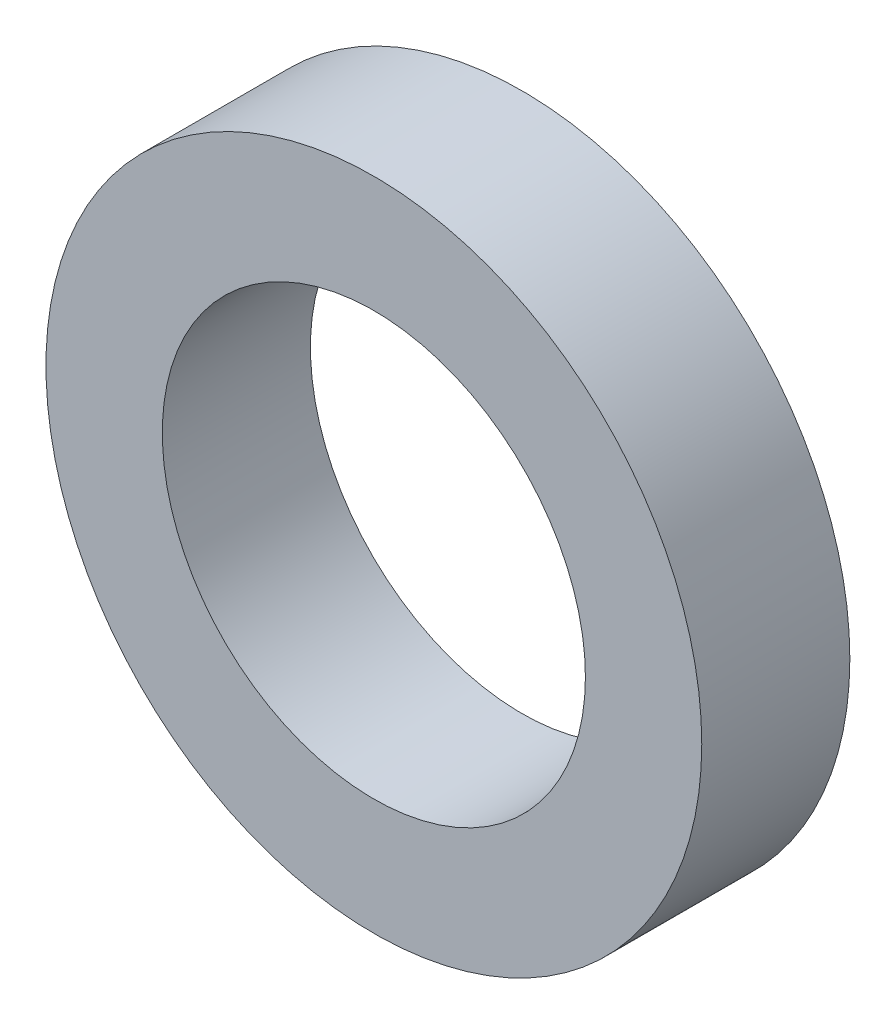
ISO-10303-21;
HEADER;
FILE_DESCRIPTION(('STEP AP214'),'2;1');
FILE_NAME('part.step','',(''),(''),'','','');
FILE_SCHEMA(('AUTOMOTIVE_DESIGN { 1 0 10303 214 1 1 1 1 }'));
ENDSEC;
DATA;
#1=APPLICATION_CONTEXT('core data for automotive mechanical design processes');
#2=APPLICATION_PROTOCOL_DEFINITION('international standard','automotive_design',2000,#1);
#3=PRODUCT_CONTEXT('',#1,'mechanical');
#4=PRODUCT('Part','Part','',(#3));
#5=PRODUCT_RELATED_PRODUCT_CATEGORY('part','',(#4));
#6=PRODUCT_DEFINITION_FORMATION('','',#4);
#7=PRODUCT_DEFINITION_CONTEXT('part definition',#1,'design');
#8=PRODUCT_DEFINITION('design','',#6,#7);
#9=PRODUCT_DEFINITION_SHAPE('','',#8);
#10=(LENGTH_UNIT() NAMED_UNIT(*) SI_UNIT(.MILLI.,.METRE.));
#11=(NAMED_UNIT(*) PLANE_ANGLE_UNIT() SI_UNIT($,.RADIAN.));
#12=(NAMED_UNIT(*) SI_UNIT($,.STERADIAN.) SOLID_ANGLE_UNIT());
#13=UNCERTAINTY_MEASURE_WITH_UNIT(LENGTH_MEASURE(1.E-05),#10,'distance_accuracy_value','');
#14=(GEOMETRIC_REPRESENTATION_CONTEXT(3) GLOBAL_UNCERTAINTY_ASSIGNED_CONTEXT((#13)) GLOBAL_UNIT_ASSIGNED_CONTEXT((#10,
#11,#12)) REPRESENTATION_CONTEXT('',''));
#15=CARTESIAN_POINT('',(0.,0.,0.));
#16=DIRECTION('',(0.,0.,1.));
#17=DIRECTION('',(1.,0.,0.));
#18=AXIS2_PLACEMENT_3D('',#15,#16,#17);
#19=CARTESIAN_POINT('',(0.,0.,-1.75));
#20=DIRECTION('',(0.,0.,1.));
#21=DIRECTION('',(1.,0.,0.));
#22=AXIS2_PLACEMENT_3D('',#19,#20,#21);
#23=CYLINDRICAL_SURFACE('',#22,7.75);
#24=CARTESIAN_POINT('',(0.,0.,-1.75));
#25=DIRECTION('',(0.,0.,1.));
#26=DIRECTION('',(1.,0.,0.));
#27=AXIS2_PLACEMENT_3D('',#24,#25,#26);
#28=CIRCLE('',#27,7.75);
#29=CARTESIAN_POINT('',(7.75,0.,-1.75));
#30=VERTEX_POINT('',#29);
#31=EDGE_CURVE('E10',#30,#30,#28,.T.);
#32=ORIENTED_EDGE('',*,*,#31,.T.);
#33=EDGE_LOOP('',(#32));
#34=FACE_BOUND('',#33,.T.);
#35=CARTESIAN_POINT('',(0.,0.,1.75));
#36=DIRECTION('',(0.,0.,1.));
#37=DIRECTION('',(1.,0.,0.));
#38=AXIS2_PLACEMENT_3D('',#35,#36,#37);
#39=CIRCLE('',#38,7.75);
#40=CARTESIAN_POINT('',(7.75,0.,1.75));
#41=VERTEX_POINT('',#40);
#42=EDGE_CURVE('E40',#41,#41,#39,.T.);
#43=ORIENTED_EDGE('',*,*,#42,.F.);
#44=EDGE_LOOP('',(#43));
#45=FACE_BOUND('',#44,.T.);
#46=ADVANCED_FACE('F37',(#34,#45),#23,.T.);
#47=CARTESIAN_POINT('',(0.,0.,-1.75));
#48=DIRECTION('',(0.,0.,1.));
#49=DIRECTION('',(1.,0.,0.));
#50=AXIS2_PLACEMENT_3D('',#47,#48,#49);
#51=PLANE('',#50);
#52=CARTESIAN_POINT('',(0.,0.,-1.75));
#53=DIRECTION('',(0.,0.,1.));
#54=DIRECTION('',(1.,0.,0.));
#55=AXIS2_PLACEMENT_3D('',#52,#53,#54);
#56=CIRCLE('',#55,5.);
#57=CARTESIAN_POINT('',(5.,0.,-1.75));
#58=VERTEX_POINT('',#57);
#59=EDGE_CURVE('E50',#58,#58,#56,.T.);
#60=ORIENTED_EDGE('',*,*,#59,.T.);
#61=EDGE_LOOP('',(#60));
#62=FACE_BOUND('',#61,.T.);
#63=ORIENTED_EDGE('',*,*,#31,.F.);
#64=EDGE_LOOP('',(#63));
#65=FACE_BOUND('',#64,.T.);
#66=ADVANCED_FACE('F59',(#62,#65),#51,.F.);
#67=CARTESIAN_POINT('',(0.,0.,1.75));
#68=DIRECTION('',(0.,0.,1.));
#69=DIRECTION('',(1.,0.,0.));
#70=AXIS2_PLACEMENT_3D('',#67,#68,#69);
#71=PLANE('',#70);
#72=CARTESIAN_POINT('',(0.,0.,1.75));
#73=DIRECTION('',(0.,0.,1.));
#74=DIRECTION('',(1.,0.,0.));
#75=AXIS2_PLACEMENT_3D('',#72,#73,#74);
#76=CIRCLE('',#75,5.);
#77=CARTESIAN_POINT('',(5.,0.,1.75));
#78=VERTEX_POINT('',#77);
#79=EDGE_CURVE('E52',#78,#78,#76,.T.);
#80=ORIENTED_EDGE('',*,*,#79,.F.);
#81=EDGE_LOOP('',(#80));
#82=FACE_BOUND('',#81,.T.);
#83=ORIENTED_EDGE('',*,*,#42,.T.);
#84=EDGE_LOOP('',(#83));
#85=FACE_BOUND('',#84,.T.);
#86=ADVANCED_FACE('F65',(#82,#85),#71,.T.);
#87=CARTESIAN_POINT('',(0.,0.,-1.75));
#88=DIRECTION('',(0.,0.,1.));
#89=DIRECTION('',(1.,0.,0.));
#90=AXIS2_PLACEMENT_3D('',#87,#88,#89);
#91=CYLINDRICAL_SURFACE('',#90,5.);
#92=ORIENTED_EDGE('',*,*,#59,.F.);
#93=EDGE_LOOP('',(#92));
#94=FACE_BOUND('',#93,.T.);
#95=ORIENTED_EDGE('',*,*,#79,.T.);
#96=EDGE_LOOP('',(#95));
#97=FACE_BOUND('',#96,.T.);
#98=ADVANCED_FACE('F62',(#94,#97),#91,.F.);
#99=CLOSED_SHELL('',(#46,#66,#86,#98));
#100=MANIFOLD_SOLID_BREP('B2',#99);
#101=ADVANCED_BREP_SHAPE_REPRESENTATION('',(#18,#100),#14);
#102=SHAPE_DEFINITION_REPRESENTATION(#9,#101);
ENDSEC;
END-ISO-10303-21;
